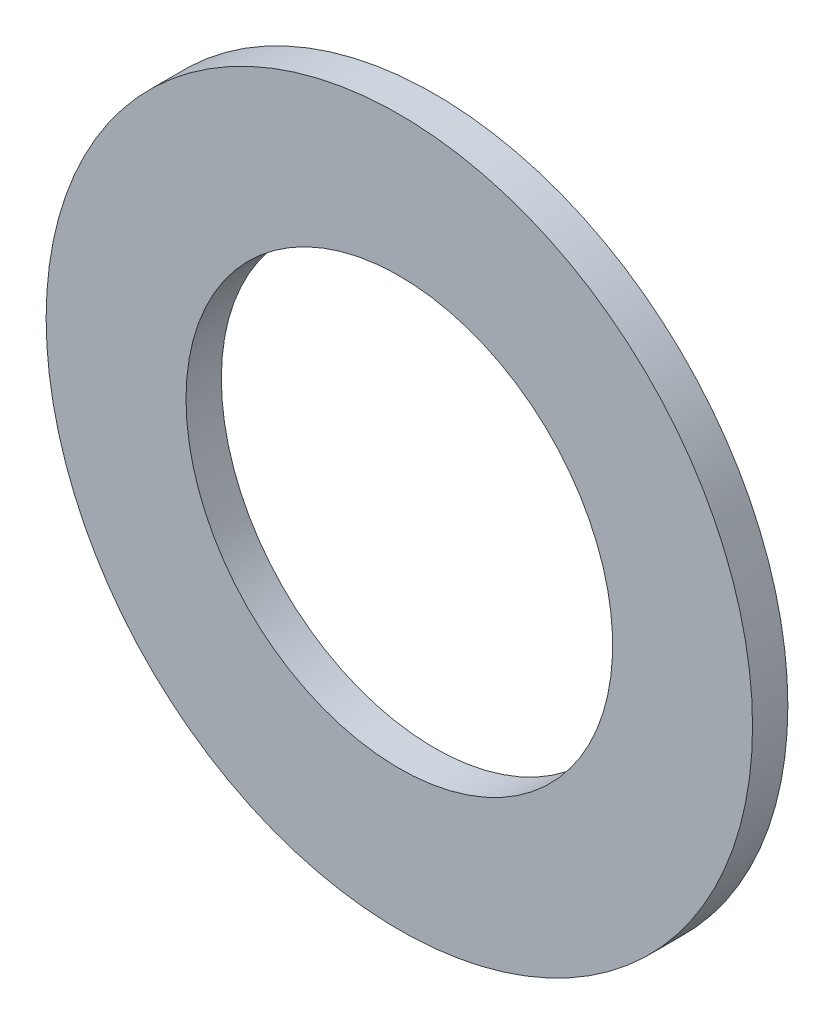
ISO-10303-21;
HEADER;
FILE_DESCRIPTION(('STEP AP214'),'2;1');
FILE_NAME('part.step','',(''),(''),'','','');
FILE_SCHEMA(('AUTOMOTIVE_DESIGN { 1 0 10303 214 1 1 1 1 }'));
ENDSEC;
DATA;
#1=APPLICATION_CONTEXT('core data for automotive mechanical design processes');
#2=APPLICATION_PROTOCOL_DEFINITION('international standard','automotive_design',2000,#1);
#3=PRODUCT_CONTEXT('',#1,'mechanical');
#4=PRODUCT('Part','Part','',(#3));
#5=PRODUCT_RELATED_PRODUCT_CATEGORY('part','',(#4));
#6=PRODUCT_DEFINITION_FORMATION('','',#4);
#7=PRODUCT_DEFINITION_CONTEXT('part definition',#1,'design');
#8=PRODUCT_DEFINITION('design','',#6,#7);
#9=PRODUCT_DEFINITION_SHAPE('','',#8);
#10=(LENGTH_UNIT() NAMED_UNIT(*) SI_UNIT(.MILLI.,.METRE.));
#11=(NAMED_UNIT(*) PLANE_ANGLE_UNIT() SI_UNIT($,.RADIAN.));
#12=(NAMED_UNIT(*) SI_UNIT($,.STERADIAN.) SOLID_ANGLE_UNIT());
#13=UNCERTAINTY_MEASURE_WITH_UNIT(LENGTH_MEASURE(1.E-05),#10,'distance_accuracy_value','');
#14=(GEOMETRIC_REPRESENTATION_CONTEXT(3) GLOBAL_UNCERTAINTY_ASSIGNED_CONTEXT((#13)) GLOBAL_UNIT_ASSIGNED_CONTEXT((#10,
#11,#12)) REPRESENTATION_CONTEXT('',''));
#15=CARTESIAN_POINT('',(0.,0.,0.));
#16=DIRECTION('',(0.,0.,1.));
#17=DIRECTION('',(1.,0.,0.));
#18=AXIS2_PLACEMENT_3D('',#15,#16,#17);
#19=CARTESIAN_POINT('',(0.,0.,-0.79375));
#20=DIRECTION('',(0.,0.,1.));
#21=DIRECTION('',(1.,0.,0.));
#22=AXIS2_PLACEMENT_3D('',#19,#20,#21);
#23=PLANE('',#22);
#24=CARTESIAN_POINT('',(0.,0.,-0.79375));
#25=DIRECTION('',(0.,0.,-1.));
#26=DIRECTION('',(-1.,0.,0.));
#27=AXIS2_PLACEMENT_3D('',#24,#25,#26);
#28=CIRCLE('',#27,9.5885);
#29=CARTESIAN_POINT('',(-9.5885,0.,-0.79375));
#30=VERTEX_POINT('',#29);
#31=EDGE_CURVE('E26',#30,#30,#28,.F.);
#32=ORIENTED_EDGE('',*,*,#31,.T.);
#33=EDGE_LOOP('',(#32));
#34=FACE_BOUND('',#33,.T.);
#35=CARTESIAN_POINT('',(0.,0.,-0.79375));
#36=DIRECTION('',(0.,0.,-1.));
#37=DIRECTION('',(-1.,0.,0.));
#38=AXIS2_PLACEMENT_3D('',#35,#36,#37);
#39=CIRCLE('',#38,15.875);
#40=CARTESIAN_POINT('',(-15.875,0.,-0.79375));
#41=VERTEX_POINT('',#40);
#42=EDGE_CURVE('E17',#41,#41,#39,.F.);
#43=ORIENTED_EDGE('',*,*,#42,.F.);
#44=EDGE_LOOP('',(#43));
#45=FACE_BOUND('',#44,.T.);
#46=ADVANCED_FACE('F14',(#34,#45),#23,.F.);
#47=CARTESIAN_POINT('',(0.,0.,0.79375));
#48=DIRECTION('',(0.,0.,-1.));
#49=DIRECTION('',(-1.,0.,0.));
#50=AXIS2_PLACEMENT_3D('',#47,#48,#49);
#51=CYLINDRICAL_SURFACE('',#50,15.875);
#52=ORIENTED_EDGE('',*,*,#42,.T.);
#53=EDGE_LOOP('',(#52));
#54=FACE_BOUND('',#53,.T.);
#55=CARTESIAN_POINT('',(0.,0.,0.79375));
#56=DIRECTION('',(0.,0.,-1.));
#57=DIRECTION('',(-1.,0.,0.));
#58=AXIS2_PLACEMENT_3D('',#55,#56,#57);
#59=CIRCLE('',#58,15.875);
#60=CARTESIAN_POINT('',(-15.875,0.,0.79375));
#61=VERTEX_POINT('',#60);
#62=EDGE_CURVE('E21',#61,#61,#59,.F.);
#63=ORIENTED_EDGE('',*,*,#62,.F.);
#64=EDGE_LOOP('',(#63));
#65=FACE_BOUND('',#64,.T.);
#66=ADVANCED_FACE('F34',(#54,#65),#51,.T.);
#67=CARTESIAN_POINT('',(0.,0.,0.79375));
#68=DIRECTION('',(0.,0.,-1.));
#69=DIRECTION('',(-1.,0.,0.));
#70=AXIS2_PLACEMENT_3D('',#67,#68,#69);
#71=CYLINDRICAL_SURFACE('',#70,9.5885);
#72=CARTESIAN_POINT('',(0.,0.,0.79375));
#73=DIRECTION('',(0.,0.,-1.));
#74=DIRECTION('',(-1.,0.,0.));
#75=AXIS2_PLACEMENT_3D('',#72,#73,#74);
#76=CIRCLE('',#75,9.5885);
#77=CARTESIAN_POINT('',(-9.5885,0.,0.79375));
#78=VERTEX_POINT('',#77);
#79=EDGE_CURVE('E10',#78,#78,#76,.T.);
#80=ORIENTED_EDGE('',*,*,#79,.F.);
#81=EDGE_LOOP('',(#80));
#82=FACE_BOUND('',#81,.T.);
#83=ORIENTED_EDGE('',*,*,#31,.F.);
#84=EDGE_LOOP('',(#83));
#85=FACE_BOUND('',#84,.T.);
#86=ADVANCED_FACE('F42',(#82,#85),#71,.F.);
#87=CARTESIAN_POINT('',(0.,0.,0.79375));
#88=DIRECTION('',(0.,0.,1.));
#89=DIRECTION('',(1.,0.,0.));
#90=AXIS2_PLACEMENT_3D('',#87,#88,#89);
#91=PLANE('',#90);
#92=ORIENTED_EDGE('',*,*,#79,.T.);
#93=EDGE_LOOP('',(#92));
#94=FACE_BOUND('',#93,.T.);
#95=ORIENTED_EDGE('',*,*,#62,.T.);
#96=EDGE_LOOP('',(#95));
#97=FACE_BOUND('',#96,.T.);
#98=ADVANCED_FACE('F43',(#94,#97),#91,.T.);
#99=CLOSED_SHELL('',(#46,#66,#86,#98));
#100=MANIFOLD_SOLID_BREP('B1',#99);
#101=ADVANCED_BREP_SHAPE_REPRESENTATION('',(#18,#100),#14);
#102=SHAPE_DEFINITION_REPRESENTATION(#9,#101);
ENDSEC;
END-ISO-10303-21;
